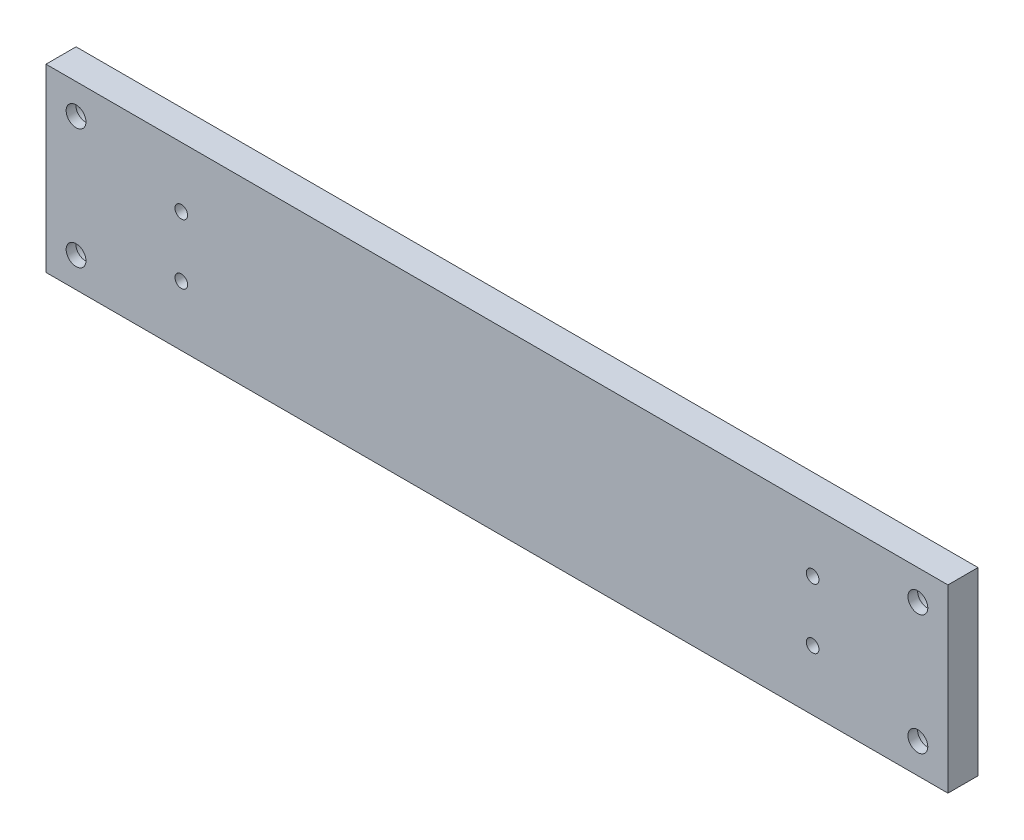
ISO-10303-21;
HEADER;
FILE_DESCRIPTION(('STEP AP214'),'2;1');
FILE_NAME('part.step','',(''),(''),'','','');
FILE_SCHEMA(('AUTOMOTIVE_DESIGN { 1 0 10303 214 1 1 1 1 }'));
ENDSEC;
DATA;
#1=APPLICATION_CONTEXT('core data for automotive mechanical design processes');
#2=APPLICATION_PROTOCOL_DEFINITION('international standard','automotive_design',2000,#1);
#3=PRODUCT_CONTEXT('',#1,'mechanical');
#4=PRODUCT('Part','Part','',(#3));
#5=PRODUCT_RELATED_PRODUCT_CATEGORY('part','',(#4));
#6=PRODUCT_DEFINITION_FORMATION('','',#4);
#7=PRODUCT_DEFINITION_CONTEXT('part definition',#1,'design');
#8=PRODUCT_DEFINITION('design','',#6,#7);
#9=PRODUCT_DEFINITION_SHAPE('','',#8);
#10=(LENGTH_UNIT() NAMED_UNIT(*) SI_UNIT(.MILLI.,.METRE.));
#11=(NAMED_UNIT(*) PLANE_ANGLE_UNIT() SI_UNIT($,.RADIAN.));
#12=(NAMED_UNIT(*) SI_UNIT($,.STERADIAN.) SOLID_ANGLE_UNIT());
#13=UNCERTAINTY_MEASURE_WITH_UNIT(LENGTH_MEASURE(1.E-05),#10,'distance_accuracy_value','');
#14=(GEOMETRIC_REPRESENTATION_CONTEXT(3) GLOBAL_UNCERTAINTY_ASSIGNED_CONTEXT((#13)) GLOBAL_UNIT_ASSIGNED_CONTEXT((#10,
#11,#12)) REPRESENTATION_CONTEXT('',''));
#15=CARTESIAN_POINT('',(0.,0.,0.));
#16=DIRECTION('',(0.,0.,1.));
#17=DIRECTION('',(1.,0.,0.));
#18=AXIS2_PLACEMENT_3D('',#15,#16,#17);
#19=CARTESIAN_POINT('',(0.,-60.,5.));
#20=DIRECTION('',(1.,0.,0.));
#21=DIRECTION('',(0.,0.,-1.));
#22=AXIS2_PLACEMENT_3D('',#19,#20,#21);
#23=PLANE('',#22);
#24=DIRECTION('',(0.,-1.,0.));
#25=VECTOR('',#24,1.);
#26=CARTESIAN_POINT('',(0.,-60.,-5.));
#27=LINE('',#26,#25);
#28=CARTESIAN_POINT('',(0.,0.,-5.));
#29=VERTEX_POINT('',#28);
#30=CARTESIAN_POINT('',(0.,-60.,-5.));
#31=VERTEX_POINT('',#30);
#32=EDGE_CURVE('E126',#29,#31,#27,.T.);
#33=ORIENTED_EDGE('',*,*,#32,.T.);
#34=DIRECTION('',(0.,0.,-1.));
#35=VECTOR('',#34,1.);
#36=CARTESIAN_POINT('',(0.,-60.,5.));
#37=LINE('',#36,#35);
#38=CARTESIAN_POINT('',(0.,-60.,5.));
#39=VERTEX_POINT('',#38);
#40=EDGE_CURVE('E11',#39,#31,#37,.T.);
#41=ORIENTED_EDGE('',*,*,#40,.F.);
#42=DIRECTION('',(0.,-1.,0.));
#43=VECTOR('',#42,1.);
#44=CARTESIAN_POINT('',(0.,-60.,5.));
#45=LINE('',#44,#43);
#46=CARTESIAN_POINT('',(0.,0.,5.));
#47=VERTEX_POINT('',#46);
#48=EDGE_CURVE('E127',#47,#39,#45,.T.);
#49=ORIENTED_EDGE('',*,*,#48,.F.);
#50=DIRECTION('',(0.,0.,-1.));
#51=VECTOR('',#50,1.);
#52=CARTESIAN_POINT('',(0.,0.,5.));
#53=LINE('',#52,#51);
#54=EDGE_CURVE('E133',#47,#29,#53,.T.);
#55=ORIENTED_EDGE('',*,*,#54,.T.);
#56=EDGE_LOOP('',(#33,#41,#49,#55));
#57=FACE_BOUND('',#56,.T.);
#58=ADVANCED_FACE('F40',(#57),#23,.F.);
#59=CARTESIAN_POINT('',(0.,-60.,5.));
#60=DIRECTION('',(0.,1.,0.));
#61=DIRECTION('',(0.,0.,1.));
#62=AXIS2_PLACEMENT_3D('',#59,#60,#61);
#63=PLANE('',#62);
#64=CARTESIAN_POINT('',(30.,-60.,0.));
#65=DIRECTION('',(0.,-1.,0.));
#66=DIRECTION('',(0.,0.,-1.));
#67=AXIS2_PLACEMENT_3D('',#64,#65,#66);
#68=CIRCLE('',#67,2.49999999999999);
#69=CARTESIAN_POINT('',(30.,-60.,-2.49999999999999));
#70=VERTEX_POINT('',#69);
#71=EDGE_CURVE('E108',#70,#70,#68,.T.);
#72=ORIENTED_EDGE('',*,*,#71,.F.);
#73=EDGE_LOOP('',(#72));
#74=FACE_BOUND('',#73,.T.);
#75=CARTESIAN_POINT('',(270.,-60.,0.));
#76=DIRECTION('',(0.,-1.,0.));
#77=DIRECTION('',(0.,0.,-1.));
#78=AXIS2_PLACEMENT_3D('',#75,#76,#77);
#79=CIRCLE('',#78,2.5);
#80=CARTESIAN_POINT('',(270.,-60.,-2.49999999999997));
#81=VERTEX_POINT('',#80);
#82=EDGE_CURVE('E107',#81,#81,#79,.T.);
#83=ORIENTED_EDGE('',*,*,#82,.F.);
#84=EDGE_LOOP('',(#83));
#85=FACE_BOUND('',#84,.T.);
#86=CARTESIAN_POINT('',(150.,-60.,0.));
#87=DIRECTION('',(0.,-1.,0.));
#88=DIRECTION('',(0.,0.,-1.));
#89=AXIS2_PLACEMENT_3D('',#86,#87,#88);
#90=CIRCLE('',#89,2.5);
#91=CARTESIAN_POINT('',(150.,-60.,-2.49999999999999));
#92=VERTEX_POINT('',#91);
#93=EDGE_CURVE('E120',#92,#92,#90,.T.);
#94=ORIENTED_EDGE('',*,*,#93,.F.);
#95=EDGE_LOOP('',(#94));
#96=FACE_BOUND('',#95,.T.);
#97=DIRECTION('',(1.,0.,0.));
#98=VECTOR('',#97,1.);
#99=CARTESIAN_POINT('',(0.,-60.,-5.));
#100=LINE('',#99,#98);
#101=CARTESIAN_POINT('',(300.,-60.,-5.));
#102=VERTEX_POINT('',#101);
#103=EDGE_CURVE('E136',#31,#102,#100,.T.);
#104=ORIENTED_EDGE('',*,*,#103,.T.);
#105=DIRECTION('',(0.,0.,-1.));
#106=VECTOR('',#105,1.);
#107=CARTESIAN_POINT('',(300.,-60.,5.));
#108=LINE('',#107,#106);
#109=CARTESIAN_POINT('',(300.,-60.,5.));
#110=VERTEX_POINT('',#109);
#111=EDGE_CURVE('E48',#110,#102,#108,.T.);
#112=ORIENTED_EDGE('',*,*,#111,.F.);
#113=DIRECTION('',(1.,0.,0.));
#114=VECTOR('',#113,1.);
#115=CARTESIAN_POINT('',(0.,-60.,5.));
#116=LINE('',#115,#114);
#117=EDGE_CURVE('E87',#39,#110,#116,.T.);
#118=ORIENTED_EDGE('',*,*,#117,.F.);
#119=ORIENTED_EDGE('',*,*,#40,.T.);
#120=EDGE_LOOP('',(#104,#112,#118,#119));
#121=FACE_BOUND('',#120,.T.);
#122=ADVANCED_FACE('F160',(#74,#85,#96,#121),#63,.F.);
#123=CARTESIAN_POINT('',(300.,0.,5.));
#124=DIRECTION('',(-1.,0.,0.));
#125=DIRECTION('',(0.,0.,1.));
#126=AXIS2_PLACEMENT_3D('',#123,#124,#125);
#127=PLANE('',#126);
#128=DIRECTION('',(0.,1.,0.));
#129=VECTOR('',#128,1.);
#130=CARTESIAN_POINT('',(300.,0.,-5.));
#131=LINE('',#130,#129);
#132=CARTESIAN_POINT('',(300.,0.,-5.));
#133=VERTEX_POINT('',#132);
#134=EDGE_CURVE('E74',#102,#133,#131,.T.);
#135=ORIENTED_EDGE('',*,*,#134,.T.);
#136=DIRECTION('',(0.,0.,-1.));
#137=VECTOR('',#136,1.);
#138=CARTESIAN_POINT('',(300.,0.,5.));
#139=LINE('',#138,#137);
#140=CARTESIAN_POINT('',(300.,0.,5.));
#141=VERTEX_POINT('',#140);
#142=EDGE_CURVE('E141',#141,#133,#139,.T.);
#143=ORIENTED_EDGE('',*,*,#142,.F.);
#144=DIRECTION('',(0.,1.,0.));
#145=VECTOR('',#144,1.);
#146=CARTESIAN_POINT('',(300.,0.,5.));
#147=LINE('',#146,#145);
#148=EDGE_CURVE('E130',#110,#141,#147,.T.);
#149=ORIENTED_EDGE('',*,*,#148,.F.);
#150=ORIENTED_EDGE('',*,*,#111,.T.);
#151=EDGE_LOOP('',(#135,#143,#149,#150));
#152=FACE_BOUND('',#151,.T.);
#153=ADVANCED_FACE('F143',(#152),#127,.F.);
#154=CARTESIAN_POINT('',(0.,0.,5.));
#155=DIRECTION('',(0.,-1.,0.));
#156=DIRECTION('',(0.,0.,-1.));
#157=AXIS2_PLACEMENT_3D('',#154,#155,#156);
#158=PLANE('',#157);
#159=DIRECTION('',(-1.,0.,0.));
#160=VECTOR('',#159,1.);
#161=CARTESIAN_POINT('',(0.,0.,-5.));
#162=LINE('',#161,#160);
#163=EDGE_CURVE('E80',#133,#29,#162,.T.);
#164=ORIENTED_EDGE('',*,*,#163,.T.);
#165=ORIENTED_EDGE('',*,*,#54,.F.);
#166=DIRECTION('',(-1.,0.,0.));
#167=VECTOR('',#166,1.);
#168=CARTESIAN_POINT('',(0.,0.,5.));
#169=LINE('',#168,#167);
#170=EDGE_CURVE('E56',#141,#47,#169,.T.);
#171=ORIENTED_EDGE('',*,*,#170,.F.);
#172=ORIENTED_EDGE('',*,*,#142,.T.);
#173=EDGE_LOOP('',(#164,#165,#171,#172));
#174=FACE_BOUND('',#173,.T.);
#175=ADVANCED_FACE('F150',(#174),#158,.F.);
#176=CARTESIAN_POINT('',(0.,0.,5.));
#177=DIRECTION('',(0.,0.,-1.));
#178=DIRECTION('',(-1.,0.,0.));
#179=AXIS2_PLACEMENT_3D('',#176,#177,#178);
#180=PLANE('',#179);
#181=CARTESIAN_POINT('',(255.,-20.,5.));
#182=DIRECTION('',(0.,0.,-1.));
#183=DIRECTION('',(-1.,0.,0.));
#184=AXIS2_PLACEMENT_3D('',#181,#182,#183);
#185=CIRCLE('',#184,2.09999999999999);
#186=CARTESIAN_POINT('',(252.9,-20.,5.));
#187=VERTEX_POINT('',#186);
#188=EDGE_CURVE('E452',#187,#187,#185,.T.);
#189=ORIENTED_EDGE('',*,*,#188,.T.);
#190=EDGE_LOOP('',(#189));
#191=FACE_BOUND('',#190,.T.);
#192=CARTESIAN_POINT('',(255.,-40.,5.));
#193=DIRECTION('',(0.,0.,-1.));
#194=DIRECTION('',(-1.,0.,0.));
#195=AXIS2_PLACEMENT_3D('',#192,#193,#194);
#196=CIRCLE('',#195,2.09999999999999);
#197=CARTESIAN_POINT('',(252.9,-40.,5.));
#198=VERTEX_POINT('',#197);
#199=EDGE_CURVE('E457',#198,#198,#196,.T.);
#200=ORIENTED_EDGE('',*,*,#199,.T.);
#201=EDGE_LOOP('',(#200));
#202=FACE_BOUND('',#201,.T.);
#203=CARTESIAN_POINT('',(45.,-20.,5.));
#204=DIRECTION('',(0.,0.,-1.));
#205=DIRECTION('',(-1.,0.,0.));
#206=AXIS2_PLACEMENT_3D('',#203,#204,#205);
#207=CIRCLE('',#206,2.1);
#208=CARTESIAN_POINT('',(42.9,-20.,5.));
#209=VERTEX_POINT('',#208);
#210=EDGE_CURVE('E461',#209,#209,#207,.T.);
#211=ORIENTED_EDGE('',*,*,#210,.T.);
#212=EDGE_LOOP('',(#211));
#213=FACE_BOUND('',#212,.T.);
#214=CARTESIAN_POINT('',(45.,-40.,5.));
#215=DIRECTION('',(0.,0.,-1.));
#216=DIRECTION('',(-1.,0.,0.));
#217=AXIS2_PLACEMENT_3D('',#214,#215,#216);
#218=CIRCLE('',#217,2.1);
#219=CARTESIAN_POINT('',(42.9,-40.,5.));
#220=VERTEX_POINT('',#219);
#221=EDGE_CURVE('E465',#220,#220,#218,.T.);
#222=ORIENTED_EDGE('',*,*,#221,.T.);
#223=EDGE_LOOP('',(#222));
#224=FACE_BOUND('',#223,.T.);
#225=CARTESIAN_POINT('',(9.99999999999993,-10.,5.));
#226=DIRECTION('',(0.,0.,-1.));
#227=DIRECTION('',(-1.,0.,0.));
#228=AXIS2_PLACEMENT_3D('',#225,#226,#227);
#229=CIRCLE('',#228,3.3);
#230=CARTESIAN_POINT('',(6.69999999999993,-10.,5.));
#231=VERTEX_POINT('',#230);
#232=EDGE_CURVE('E475',#231,#231,#229,.T.);
#233=ORIENTED_EDGE('',*,*,#232,.T.);
#234=EDGE_LOOP('',(#233));
#235=FACE_BOUND('',#234,.T.);
#236=CARTESIAN_POINT('',(9.99999999999993,-50.,5.));
#237=DIRECTION('',(0.,0.,-1.));
#238=DIRECTION('',(-1.,0.,0.));
#239=AXIS2_PLACEMENT_3D('',#236,#237,#238);
#240=CIRCLE('',#239,3.3);
#241=CARTESIAN_POINT('',(6.69999999999993,-50.,5.));
#242=VERTEX_POINT('',#241);
#243=EDGE_CURVE('E485',#242,#242,#240,.T.);
#244=ORIENTED_EDGE('',*,*,#243,.T.);
#245=EDGE_LOOP('',(#244));
#246=FACE_BOUND('',#245,.T.);
#247=CARTESIAN_POINT('',(290.,-10.,5.));
#248=DIRECTION('',(0.,0.,-1.));
#249=DIRECTION('',(-1.,0.,0.));
#250=AXIS2_PLACEMENT_3D('',#247,#248,#249);
#251=CIRCLE('',#250,3.30000000000003);
#252=CARTESIAN_POINT('',(286.7,-10.,5.));
#253=VERTEX_POINT('',#252);
#254=EDGE_CURVE('E229',#253,#253,#251,.T.);
#255=ORIENTED_EDGE('',*,*,#254,.T.);
#256=EDGE_LOOP('',(#255));
#257=FACE_BOUND('',#256,.T.);
#258=CARTESIAN_POINT('',(290.,-50.,5.));
#259=DIRECTION('',(0.,0.,-1.));
#260=DIRECTION('',(-1.,0.,0.));
#261=AXIS2_PLACEMENT_3D('',#258,#259,#260);
#262=CIRCLE('',#261,3.30000000000003);
#263=CARTESIAN_POINT('',(286.7,-50.,5.));
#264=VERTEX_POINT('',#263);
#265=EDGE_CURVE('E114',#264,#264,#262,.T.);
#266=ORIENTED_EDGE('',*,*,#265,.T.);
#267=EDGE_LOOP('',(#266));
#268=FACE_BOUND('',#267,.T.);
#269=ORIENTED_EDGE('',*,*,#48,.T.);
#270=ORIENTED_EDGE('',*,*,#117,.T.);
#271=ORIENTED_EDGE('',*,*,#148,.T.);
#272=ORIENTED_EDGE('',*,*,#170,.T.);
#273=EDGE_LOOP('',(#269,#270,#271,#272));
#274=FACE_BOUND('',#273,.T.);
#275=ADVANCED_FACE('F152',(#191,#202,#213,#224,#235,#246,#257,#268,#274),#180,.F.);
#276=CARTESIAN_POINT('',(0.,0.,-5.));
#277=DIRECTION('',(0.,0.,-1.));
#278=DIRECTION('',(-1.,0.,0.));
#279=AXIS2_PLACEMENT_3D('',#276,#277,#278);
#280=PLANE('',#279);
#281=CARTESIAN_POINT('',(255.,-20.,-5.));
#282=DIRECTION('',(0.,0.,-1.));
#283=DIRECTION('',(-1.,0.,0.));
#284=AXIS2_PLACEMENT_3D('',#281,#282,#283);
#285=CIRCLE('',#284,2.09999999999999);
#286=CARTESIAN_POINT('',(252.9,-20.,-5.));
#287=VERTEX_POINT('',#286);
#288=EDGE_CURVE('E199',#287,#287,#285,.T.);
#289=ORIENTED_EDGE('',*,*,#288,.F.);
#290=EDGE_LOOP('',(#289));
#291=FACE_BOUND('',#290,.T.);
#292=CARTESIAN_POINT('',(255.,-40.,-5.));
#293=DIRECTION('',(0.,0.,-1.));
#294=DIRECTION('',(-1.,0.,0.));
#295=AXIS2_PLACEMENT_3D('',#292,#293,#294);
#296=CIRCLE('',#295,2.09999999999999);
#297=CARTESIAN_POINT('',(252.9,-40.,-5.));
#298=VERTEX_POINT('',#297);
#299=EDGE_CURVE('E203',#298,#298,#296,.T.);
#300=ORIENTED_EDGE('',*,*,#299,.F.);
#301=EDGE_LOOP('',(#300));
#302=FACE_BOUND('',#301,.T.);
#303=CARTESIAN_POINT('',(45.,-20.,-5.));
#304=DIRECTION('',(0.,0.,-1.));
#305=DIRECTION('',(-1.,0.,0.));
#306=AXIS2_PLACEMENT_3D('',#303,#304,#305);
#307=CIRCLE('',#306,2.09999999999999);
#308=CARTESIAN_POINT('',(42.9,-20.,-5.));
#309=VERTEX_POINT('',#308);
#310=EDGE_CURVE('E207',#309,#309,#307,.T.);
#311=ORIENTED_EDGE('',*,*,#310,.F.);
#312=EDGE_LOOP('',(#311));
#313=FACE_BOUND('',#312,.T.);
#314=CARTESIAN_POINT('',(45.,-40.,-5.));
#315=DIRECTION('',(0.,0.,-1.));
#316=DIRECTION('',(-1.,0.,0.));
#317=AXIS2_PLACEMENT_3D('',#314,#315,#316);
#318=CIRCLE('',#317,2.09999999999999);
#319=CARTESIAN_POINT('',(42.9,-40.,-5.));
#320=VERTEX_POINT('',#319);
#321=EDGE_CURVE('E211',#320,#320,#318,.T.);
#322=ORIENTED_EDGE('',*,*,#321,.F.);
#323=EDGE_LOOP('',(#322));
#324=FACE_BOUND('',#323,.T.);
#325=CARTESIAN_POINT('',(9.99999999999993,-10.,-5.));
#326=DIRECTION('',(0.,0.,-1.));
#327=DIRECTION('',(-1.,0.,0.));
#328=AXIS2_PLACEMENT_3D('',#325,#326,#327);
#329=CIRCLE('',#328,5.5);
#330=CARTESIAN_POINT('',(4.49999999999993,-10.,-5.));
#331=VERTEX_POINT('',#330);
#332=EDGE_CURVE('E215',#331,#331,#329,.T.);
#333=ORIENTED_EDGE('',*,*,#332,.F.);
#334=EDGE_LOOP('',(#333));
#335=FACE_BOUND('',#334,.T.);
#336=CARTESIAN_POINT('',(9.99999999999993,-50.,-5.));
#337=DIRECTION('',(0.,0.,-1.));
#338=DIRECTION('',(-1.,0.,0.));
#339=AXIS2_PLACEMENT_3D('',#336,#337,#338);
#340=CIRCLE('',#339,5.5);
#341=CARTESIAN_POINT('',(4.49999999999993,-50.,-5.));
#342=VERTEX_POINT('',#341);
#343=EDGE_CURVE('E219',#342,#342,#340,.T.);
#344=ORIENTED_EDGE('',*,*,#343,.F.);
#345=EDGE_LOOP('',(#344));
#346=FACE_BOUND('',#345,.T.);
#347=CARTESIAN_POINT('',(290.,-10.,-5.));
#348=DIRECTION('',(0.,0.,-1.));
#349=DIRECTION('',(-1.,0.,0.));
#350=AXIS2_PLACEMENT_3D('',#347,#348,#349);
#351=CIRCLE('',#350,5.50000000000001);
#352=CARTESIAN_POINT('',(284.5,-10.,-5.));
#353=VERTEX_POINT('',#352);
#354=EDGE_CURVE('E223',#353,#353,#351,.T.);
#355=ORIENTED_EDGE('',*,*,#354,.F.);
#356=EDGE_LOOP('',(#355));
#357=FACE_BOUND('',#356,.T.);
#358=CARTESIAN_POINT('',(290.,-50.,-5.));
#359=DIRECTION('',(0.,0.,-1.));
#360=DIRECTION('',(-1.,0.,0.));
#361=AXIS2_PLACEMENT_3D('',#358,#359,#360);
#362=CIRCLE('',#361,5.50000000000001);
#363=CARTESIAN_POINT('',(284.5,-50.,-5.));
#364=VERTEX_POINT('',#363);
#365=EDGE_CURVE('E226',#364,#364,#362,.T.);
#366=ORIENTED_EDGE('',*,*,#365,.F.);
#367=EDGE_LOOP('',(#366));
#368=FACE_BOUND('',#367,.T.);
#369=ORIENTED_EDGE('',*,*,#32,.F.);
#370=ORIENTED_EDGE('',*,*,#163,.F.);
#371=ORIENTED_EDGE('',*,*,#134,.F.);
#372=ORIENTED_EDGE('',*,*,#103,.F.);
#373=EDGE_LOOP('',(#369,#370,#371,#372));
#374=FACE_BOUND('',#373,.T.);
#375=ADVANCED_FACE('F146',(#291,#302,#313,#324,#335,#346,#357,#368,#374),#280,.T.);
#376=CARTESIAN_POINT('',(150.,-45.,0.));
#377=DIRECTION('',(0.,-1.,0.));
#378=DIRECTION('',(0.,0.,-1.));
#379=AXIS2_PLACEMENT_3D('',#376,#377,#378);
#380=CONICAL_SURFACE('',#379,2.5,1.02974425867666);
#381=CARTESIAN_POINT('',(150.,-43.4978484524311,0.));
#382=VERTEX_POINT('',#381);
#383=VERTEX_LOOP('',#382);
#384=FACE_BOUND('',#383,.T.);
#385=CARTESIAN_POINT('',(150.,-45.,0.));
#386=DIRECTION('',(0.,-1.,0.));
#387=DIRECTION('',(0.,0.,-1.));
#388=AXIS2_PLACEMENT_3D('',#385,#386,#387);
#389=CIRCLE('',#388,2.5);
#390=CARTESIAN_POINT('',(150.,-45.,-2.49999999999999));
#391=VERTEX_POINT('',#390);
#392=EDGE_CURVE('E123',#391,#391,#389,.T.);
#393=ORIENTED_EDGE('',*,*,#392,.T.);
#394=EDGE_LOOP('',(#393));
#395=FACE_BOUND('',#394,.T.);
#396=ADVANCED_FACE('F179',(#384,#395),#380,.F.);
#397=CARTESIAN_POINT('',(150.,-60.,0.));
#398=DIRECTION('',(0.,-1.,0.));
#399=DIRECTION('',(0.,0.,-1.));
#400=AXIS2_PLACEMENT_3D('',#397,#398,#399);
#401=CYLINDRICAL_SURFACE('',#400,2.5);
#402=ORIENTED_EDGE('',*,*,#392,.F.);
#403=EDGE_LOOP('',(#402));
#404=FACE_BOUND('',#403,.T.);
#405=ORIENTED_EDGE('',*,*,#93,.T.);
#406=EDGE_LOOP('',(#405));
#407=FACE_BOUND('',#406,.T.);
#408=ADVANCED_FACE('F176',(#404,#407),#401,.F.);
#409=CARTESIAN_POINT('',(270.,-45.,0.));
#410=DIRECTION('',(0.,-1.,0.));
#411=DIRECTION('',(0.,0.,-1.));
#412=AXIS2_PLACEMENT_3D('',#409,#410,#411);
#413=CONICAL_SURFACE('',#412,2.5,1.02974425867666);
#414=CARTESIAN_POINT('',(270.,-43.4978484524311,0.));
#415=VERTEX_POINT('',#414);
#416=VERTEX_LOOP('',#415);
#417=FACE_BOUND('',#416,.T.);
#418=CARTESIAN_POINT('',(270.,-45.,0.));
#419=DIRECTION('',(0.,-1.,0.));
#420=DIRECTION('',(0.,0.,-1.));
#421=AXIS2_PLACEMENT_3D('',#418,#419,#420);
#422=CIRCLE('',#421,2.5);
#423=CARTESIAN_POINT('',(270.,-45.,-2.49999999999997));
#424=VERTEX_POINT('',#423);
#425=EDGE_CURVE('E111',#424,#424,#422,.T.);
#426=ORIENTED_EDGE('',*,*,#425,.T.);
#427=EDGE_LOOP('',(#426));
#428=FACE_BOUND('',#427,.T.);
#429=ADVANCED_FACE('F178',(#417,#428),#413,.F.);
#430=CARTESIAN_POINT('',(270.,-60.,0.));
#431=DIRECTION('',(0.,-1.,0.));
#432=DIRECTION('',(0.,0.,-1.));
#433=AXIS2_PLACEMENT_3D('',#430,#431,#432);
#434=CYLINDRICAL_SURFACE('',#433,2.5);
#435=ORIENTED_EDGE('',*,*,#425,.F.);
#436=EDGE_LOOP('',(#435));
#437=FACE_BOUND('',#436,.T.);
#438=ORIENTED_EDGE('',*,*,#82,.T.);
#439=EDGE_LOOP('',(#438));
#440=FACE_BOUND('',#439,.T.);
#441=ADVANCED_FACE('F101',(#437,#440),#434,.F.);
#442=CARTESIAN_POINT('',(30.,-45.,0.));
#443=DIRECTION('',(0.,-1.,0.));
#444=DIRECTION('',(0.,0.,-1.));
#445=AXIS2_PLACEMENT_3D('',#442,#443,#444);
#446=CONICAL_SURFACE('',#445,2.49999999999999,1.02974425867665);
#447=CARTESIAN_POINT('',(30.,-43.4978484524311,0.));
#448=VERTEX_POINT('',#447);
#449=VERTEX_LOOP('',#448);
#450=FACE_BOUND('',#449,.T.);
#451=CARTESIAN_POINT('',(30.,-45.,0.));
#452=DIRECTION('',(0.,-1.,0.));
#453=DIRECTION('',(0.,0.,-1.));
#454=AXIS2_PLACEMENT_3D('',#451,#452,#453);
#455=CIRCLE('',#454,2.49999999999999);
#456=CARTESIAN_POINT('',(30.,-45.,-2.49999999999999));
#457=VERTEX_POINT('',#456);
#458=EDGE_CURVE('E105',#457,#457,#455,.T.);
#459=ORIENTED_EDGE('',*,*,#458,.T.);
#460=EDGE_LOOP('',(#459));
#461=FACE_BOUND('',#460,.T.);
#462=ADVANCED_FACE('F97',(#450,#461),#446,.F.);
#463=CARTESIAN_POINT('',(30.,-60.,0.));
#464=DIRECTION('',(0.,-1.,0.));
#465=DIRECTION('',(0.,0.,-1.));
#466=AXIS2_PLACEMENT_3D('',#463,#464,#465);
#467=CYLINDRICAL_SURFACE('',#466,2.49999999999999);
#468=ORIENTED_EDGE('',*,*,#458,.F.);
#469=EDGE_LOOP('',(#468));
#470=FACE_BOUND('',#469,.T.);
#471=ORIENTED_EDGE('',*,*,#71,.T.);
#472=EDGE_LOOP('',(#471));
#473=FACE_BOUND('',#472,.T.);
#474=ADVANCED_FACE('F100',(#470,#473),#467,.F.);
#475=CARTESIAN_POINT('',(290.,-50.,-5.));
#476=DIRECTION('',(0.,0.,-1.));
#477=DIRECTION('',(-1.,0.,0.));
#478=AXIS2_PLACEMENT_3D('',#475,#476,#477);
#479=CYLINDRICAL_SURFACE('',#478,3.30000000000003);
#480=ORIENTED_EDGE('',*,*,#265,.F.);
#481=EDGE_LOOP('',(#480));
#482=FACE_BOUND('',#481,.T.);
#483=CARTESIAN_POINT('',(290.,-50.,1.8));
#484=DIRECTION('',(0.,0.,-1.));
#485=DIRECTION('',(-1.,0.,0.));
#486=AXIS2_PLACEMENT_3D('',#483,#484,#485);
#487=CIRCLE('',#486,3.30000000000003);
#488=CARTESIAN_POINT('',(286.7,-50.,1.8));
#489=VERTEX_POINT('',#488);
#490=EDGE_CURVE('E232',#489,#489,#487,.T.);
#491=ORIENTED_EDGE('',*,*,#490,.T.);
#492=EDGE_LOOP('',(#491));
#493=FACE_BOUND('',#492,.T.);
#494=ADVANCED_FACE('F244',(#482,#493),#479,.F.);
#495=CARTESIAN_POINT('',(293.3,-50.,1.8));
#496=DIRECTION('',(0.,0.,1.));
#497=DIRECTION('',(1.,0.,0.));
#498=AXIS2_PLACEMENT_3D('',#495,#496,#497);
#499=PLANE('',#498);
#500=ORIENTED_EDGE('',*,*,#490,.F.);
#501=EDGE_LOOP('',(#500));
#502=FACE_BOUND('',#501,.T.);
#503=CARTESIAN_POINT('',(290.,-50.,1.8));
#504=DIRECTION('',(0.,0.,-1.));
#505=DIRECTION('',(-1.,0.,0.));
#506=AXIS2_PLACEMENT_3D('',#503,#504,#505);
#507=CIRCLE('',#506,5.50000000000001);
#508=CARTESIAN_POINT('',(284.5,-50.,1.8));
#509=VERTEX_POINT('',#508);
#510=EDGE_CURVE('E228',#509,#509,#507,.T.);
#511=ORIENTED_EDGE('',*,*,#510,.T.);
#512=EDGE_LOOP('',(#511));
#513=FACE_BOUND('',#512,.T.);
#514=ADVANCED_FACE('F247',(#502,#513),#499,.F.);
#515=CARTESIAN_POINT('',(290.,-50.,-5.));
#516=DIRECTION('',(0.,0.,-1.));
#517=DIRECTION('',(-1.,0.,0.));
#518=AXIS2_PLACEMENT_3D('',#515,#516,#517);
#519=CYLINDRICAL_SURFACE('',#518,5.50000000000001);
#520=ORIENTED_EDGE('',*,*,#510,.F.);
#521=EDGE_LOOP('',(#520));
#522=FACE_BOUND('',#521,.T.);
#523=ORIENTED_EDGE('',*,*,#365,.T.);
#524=EDGE_LOOP('',(#523));
#525=FACE_BOUND('',#524,.T.);
#526=ADVANCED_FACE('F253',(#522,#525),#519,.F.);
#527=CARTESIAN_POINT('',(290.,-10.,-5.));
#528=DIRECTION('',(0.,0.,-1.));
#529=DIRECTION('',(-1.,0.,0.));
#530=AXIS2_PLACEMENT_3D('',#527,#528,#529);
#531=CYLINDRICAL_SURFACE('',#530,3.30000000000003);
#532=ORIENTED_EDGE('',*,*,#254,.F.);
#533=EDGE_LOOP('',(#532));
#534=FACE_BOUND('',#533,.T.);
#535=CARTESIAN_POINT('',(290.,-10.,1.8));
#536=DIRECTION('',(0.,0.,-1.));
#537=DIRECTION('',(-1.,0.,0.));
#538=AXIS2_PLACEMENT_3D('',#535,#536,#537);
#539=CIRCLE('',#538,3.30000000000003);
#540=CARTESIAN_POINT('',(286.7,-10.,1.8));
#541=VERTEX_POINT('',#540);
#542=EDGE_CURVE('E235',#541,#541,#539,.T.);
#543=ORIENTED_EDGE('',*,*,#542,.T.);
#544=EDGE_LOOP('',(#543));
#545=FACE_BOUND('',#544,.T.);
#546=ADVANCED_FACE('F258',(#534,#545),#531,.F.);
#547=CARTESIAN_POINT('',(293.3,-10.,1.8));
#548=DIRECTION('',(0.,0.,1.));
#549=DIRECTION('',(1.,0.,0.));
#550=AXIS2_PLACEMENT_3D('',#547,#548,#549);
#551=PLANE('',#550);
#552=ORIENTED_EDGE('',*,*,#542,.F.);
#553=EDGE_LOOP('',(#552));
#554=FACE_BOUND('',#553,.T.);
#555=CARTESIAN_POINT('',(290.,-10.,1.8));
#556=DIRECTION('',(0.,0.,-1.));
#557=DIRECTION('',(-1.,0.,0.));
#558=AXIS2_PLACEMENT_3D('',#555,#556,#557);
#559=CIRCLE('',#558,5.50000000000001);
#560=CARTESIAN_POINT('',(284.5,-10.,1.8));
#561=VERTEX_POINT('',#560);
#562=EDGE_CURVE('E489',#561,#561,#559,.T.);
#563=ORIENTED_EDGE('',*,*,#562,.T.);
#564=EDGE_LOOP('',(#563));
#565=FACE_BOUND('',#564,.T.);
#566=ADVANCED_FACE('F263',(#554,#565),#551,.F.);
#567=CARTESIAN_POINT('',(290.,-10.,-5.));
#568=DIRECTION('',(0.,0.,-1.));
#569=DIRECTION('',(-1.,0.,0.));
#570=AXIS2_PLACEMENT_3D('',#567,#568,#569);
#571=CYLINDRICAL_SURFACE('',#570,5.50000000000001);
#572=ORIENTED_EDGE('',*,*,#562,.F.);
#573=EDGE_LOOP('',(#572));
#574=FACE_BOUND('',#573,.T.);
#575=ORIENTED_EDGE('',*,*,#354,.T.);
#576=EDGE_LOOP('',(#575));
#577=FACE_BOUND('',#576,.T.);
#578=ADVANCED_FACE('F315',(#574,#577),#571,.F.);
#579=CARTESIAN_POINT('',(9.99999999999993,-50.,-5.));
#580=DIRECTION('',(0.,0.,-1.));
#581=DIRECTION('',(-1.,0.,0.));
#582=AXIS2_PLACEMENT_3D('',#579,#580,#581);
#583=CYLINDRICAL_SURFACE('',#582,3.3);
#584=ORIENTED_EDGE('',*,*,#243,.F.);
#585=EDGE_LOOP('',(#584));
#586=FACE_BOUND('',#585,.T.);
#587=CARTESIAN_POINT('',(9.99999999999993,-50.,1.8));
#588=DIRECTION('',(0.,0.,-1.));
#589=DIRECTION('',(-1.,0.,0.));
#590=AXIS2_PLACEMENT_3D('',#587,#588,#589);
#591=CIRCLE('',#590,3.3);
#592=CARTESIAN_POINT('',(6.69999999999993,-50.,1.8));
#593=VERTEX_POINT('',#592);
#594=EDGE_CURVE('E482',#593,#593,#591,.T.);
#595=ORIENTED_EDGE('',*,*,#594,.T.);
#596=EDGE_LOOP('',(#595));
#597=FACE_BOUND('',#596,.T.);
#598=ADVANCED_FACE('F324',(#586,#597),#583,.F.);
#599=CARTESIAN_POINT('',(13.2999999999999,-50.,1.8));
#600=DIRECTION('',(0.,0.,1.));
#601=DIRECTION('',(1.,0.,0.));
#602=AXIS2_PLACEMENT_3D('',#599,#600,#601);
#603=PLANE('',#602);
#604=ORIENTED_EDGE('',*,*,#594,.F.);
#605=EDGE_LOOP('',(#604));
#606=FACE_BOUND('',#605,.T.);
#607=CARTESIAN_POINT('',(9.99999999999993,-50.,1.8));
#608=DIRECTION('',(0.,0.,-1.));
#609=DIRECTION('',(-1.,0.,0.));
#610=AXIS2_PLACEMENT_3D('',#607,#608,#609);
#611=CIRCLE('',#610,5.5);
#612=CARTESIAN_POINT('',(4.49999999999993,-50.,1.8));
#613=VERTEX_POINT('',#612);
#614=EDGE_CURVE('E479',#613,#613,#611,.T.);
#615=ORIENTED_EDGE('',*,*,#614,.T.);
#616=EDGE_LOOP('',(#615));
#617=FACE_BOUND('',#616,.T.);
#618=ADVANCED_FACE('F334',(#606,#617),#603,.F.);
#619=CARTESIAN_POINT('',(9.99999999999993,-50.,-5.));
#620=DIRECTION('',(0.,0.,-1.));
#621=DIRECTION('',(-1.,0.,0.));
#622=AXIS2_PLACEMENT_3D('',#619,#620,#621);
#623=CYLINDRICAL_SURFACE('',#622,5.5);
#624=ORIENTED_EDGE('',*,*,#614,.F.);
#625=EDGE_LOOP('',(#624));
#626=FACE_BOUND('',#625,.T.);
#627=ORIENTED_EDGE('',*,*,#343,.T.);
#628=EDGE_LOOP('',(#627));
#629=FACE_BOUND('',#628,.T.);
#630=ADVANCED_FACE('F344',(#626,#629),#623,.F.);
#631=CARTESIAN_POINT('',(9.99999999999993,-10.,-5.));
#632=DIRECTION('',(0.,0.,-1.));
#633=DIRECTION('',(-1.,0.,0.));
#634=AXIS2_PLACEMENT_3D('',#631,#632,#633);
#635=CYLINDRICAL_SURFACE('',#634,3.3);
#636=ORIENTED_EDGE('',*,*,#232,.F.);
#637=EDGE_LOOP('',(#636));
#638=FACE_BOUND('',#637,.T.);
#639=CARTESIAN_POINT('',(9.99999999999993,-10.,1.8));
#640=DIRECTION('',(0.,0.,-1.));
#641=DIRECTION('',(-1.,0.,0.));
#642=AXIS2_PLACEMENT_3D('',#639,#640,#641);
#643=CIRCLE('',#642,3.3);
#644=CARTESIAN_POINT('',(6.69999999999993,-10.,1.8));
#645=VERTEX_POINT('',#644);
#646=EDGE_CURVE('E472',#645,#645,#643,.T.);
#647=ORIENTED_EDGE('',*,*,#646,.T.);
#648=EDGE_LOOP('',(#647));
#649=FACE_BOUND('',#648,.T.);
#650=ADVANCED_FACE('F354',(#638,#649),#635,.F.);
#651=CARTESIAN_POINT('',(13.2999999999999,-10.,1.8));
#652=DIRECTION('',(0.,0.,1.));
#653=DIRECTION('',(1.,0.,0.));
#654=AXIS2_PLACEMENT_3D('',#651,#652,#653);
#655=PLANE('',#654);
#656=ORIENTED_EDGE('',*,*,#646,.F.);
#657=EDGE_LOOP('',(#656));
#658=FACE_BOUND('',#657,.T.);
#659=CARTESIAN_POINT('',(9.99999999999993,-10.,1.8));
#660=DIRECTION('',(0.,0.,-1.));
#661=DIRECTION('',(-1.,0.,0.));
#662=AXIS2_PLACEMENT_3D('',#659,#660,#661);
#663=CIRCLE('',#662,5.5);
#664=CARTESIAN_POINT('',(4.49999999999993,-10.,1.8));
#665=VERTEX_POINT('',#664);
#666=EDGE_CURVE('E469',#665,#665,#663,.T.);
#667=ORIENTED_EDGE('',*,*,#666,.T.);
#668=EDGE_LOOP('',(#667));
#669=FACE_BOUND('',#668,.T.);
#670=ADVANCED_FACE('F364',(#658,#669),#655,.F.);
#671=CARTESIAN_POINT('',(9.99999999999993,-10.,-5.));
#672=DIRECTION('',(0.,0.,-1.));
#673=DIRECTION('',(-1.,0.,0.));
#674=AXIS2_PLACEMENT_3D('',#671,#672,#673);
#675=CYLINDRICAL_SURFACE('',#674,5.5);
#676=ORIENTED_EDGE('',*,*,#666,.F.);
#677=EDGE_LOOP('',(#676));
#678=FACE_BOUND('',#677,.T.);
#679=ORIENTED_EDGE('',*,*,#332,.T.);
#680=EDGE_LOOP('',(#679));
#681=FACE_BOUND('',#680,.T.);
#682=ADVANCED_FACE('F374',(#678,#681),#675,.F.);
#683=CARTESIAN_POINT('',(45.,-40.,-5.));
#684=DIRECTION('',(0.,0.,-1.));
#685=DIRECTION('',(-1.,0.,0.));
#686=AXIS2_PLACEMENT_3D('',#683,#684,#685);
#687=CYLINDRICAL_SURFACE('',#686,2.09999999999999);
#688=ORIENTED_EDGE('',*,*,#221,.F.);
#689=EDGE_LOOP('',(#688));
#690=FACE_BOUND('',#689,.T.);
#691=ORIENTED_EDGE('',*,*,#321,.T.);
#692=EDGE_LOOP('',(#691));
#693=FACE_BOUND('',#692,.T.);
#694=ADVANCED_FACE('F384',(#690,#693),#687,.F.);
#695=CARTESIAN_POINT('',(45.,-20.,-5.));
#696=DIRECTION('',(0.,0.,-1.));
#697=DIRECTION('',(-1.,0.,0.));
#698=AXIS2_PLACEMENT_3D('',#695,#696,#697);
#699=CYLINDRICAL_SURFACE('',#698,2.09999999999999);
#700=ORIENTED_EDGE('',*,*,#210,.F.);
#701=EDGE_LOOP('',(#700));
#702=FACE_BOUND('',#701,.T.);
#703=ORIENTED_EDGE('',*,*,#310,.T.);
#704=EDGE_LOOP('',(#703));
#705=FACE_BOUND('',#704,.T.);
#706=ADVANCED_FACE('F395',(#702,#705),#699,.F.);
#707=CARTESIAN_POINT('',(255.,-40.,-5.));
#708=DIRECTION('',(0.,0.,-1.));
#709=DIRECTION('',(-1.,0.,0.));
#710=AXIS2_PLACEMENT_3D('',#707,#708,#709);
#711=CYLINDRICAL_SURFACE('',#710,2.09999999999999);
#712=ORIENTED_EDGE('',*,*,#199,.F.);
#713=EDGE_LOOP('',(#712));
#714=FACE_BOUND('',#713,.T.);
#715=ORIENTED_EDGE('',*,*,#299,.T.);
#716=EDGE_LOOP('',(#715));
#717=FACE_BOUND('',#716,.T.);
#718=ADVANCED_FACE('F407',(#714,#717),#711,.F.);
#719=CARTESIAN_POINT('',(255.,-20.,-5.));
#720=DIRECTION('',(0.,0.,-1.));
#721=DIRECTION('',(-1.,0.,0.));
#722=AXIS2_PLACEMENT_3D('',#719,#720,#721);
#723=CYLINDRICAL_SURFACE('',#722,2.09999999999999);
#724=ORIENTED_EDGE('',*,*,#188,.F.);
#725=EDGE_LOOP('',(#724));
#726=FACE_BOUND('',#725,.T.);
#727=ORIENTED_EDGE('',*,*,#288,.T.);
#728=EDGE_LOOP('',(#727));
#729=FACE_BOUND('',#728,.T.);
#730=ADVANCED_FACE('F430',(#726,#729),#723,.F.);
#731=CLOSED_SHELL('',(#58,#122,#153,#175,#275,#375,#396,#408,#429,#441,#462,#474,#494,#514,#526,
#546,#566,#578,#598,#618,#630,#650,#670,#682,#694,#706,#718,#730));
#732=MANIFOLD_SOLID_BREP('B2',#731);
#733=ADVANCED_BREP_SHAPE_REPRESENTATION('',(#18,#732),#14);
#734=SHAPE_DEFINITION_REPRESENTATION(#9,#733);
ENDSEC;
END-ISO-10303-21;
